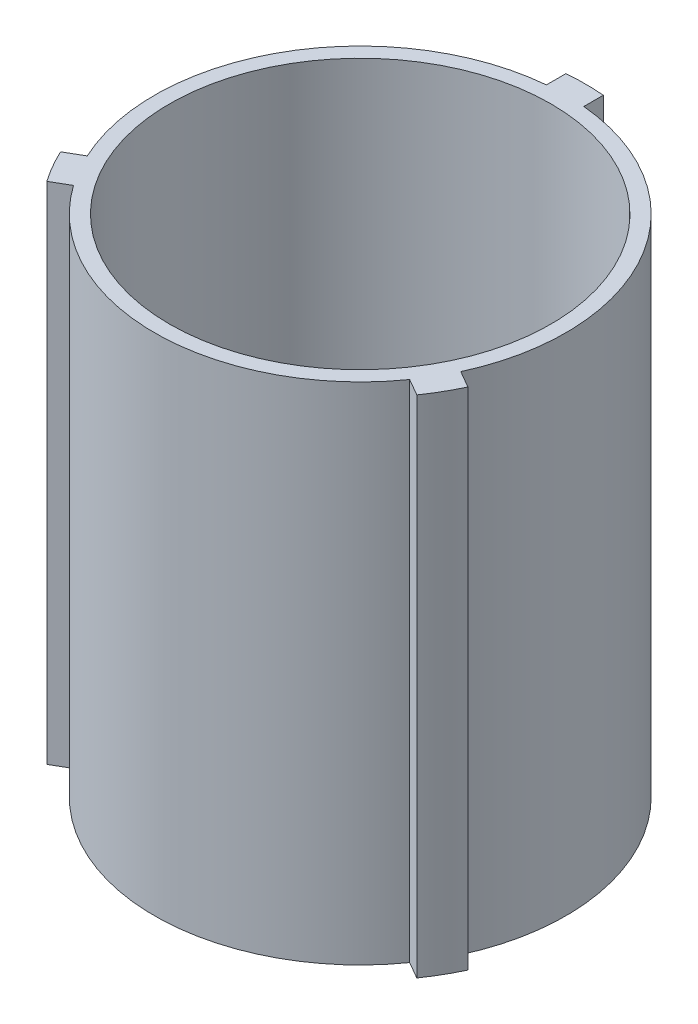
ISO-10303-21;
HEADER;
FILE_DESCRIPTION(('STEP AP214'),'2;1');
FILE_NAME('part.step','',(''),(''),'','','');
FILE_SCHEMA(('AUTOMOTIVE_DESIGN { 1 0 10303 214 1 1 1 1 }'));
ENDSEC;
DATA;
#1=APPLICATION_CONTEXT('core data for automotive mechanical design processes');
#2=APPLICATION_PROTOCOL_DEFINITION('international standard','automotive_design',2000,#1);
#3=PRODUCT_CONTEXT('',#1,'mechanical');
#4=PRODUCT('Part','Part','',(#3));
#5=PRODUCT_RELATED_PRODUCT_CATEGORY('part','',(#4));
#6=PRODUCT_DEFINITION_FORMATION('','',#4);
#7=PRODUCT_DEFINITION_CONTEXT('part definition',#1,'design');
#8=PRODUCT_DEFINITION('design','',#6,#7);
#9=PRODUCT_DEFINITION_SHAPE('','',#8);
#10=(LENGTH_UNIT() NAMED_UNIT(*) SI_UNIT(.MILLI.,.METRE.));
#11=(NAMED_UNIT(*) PLANE_ANGLE_UNIT() SI_UNIT($,.RADIAN.));
#12=(NAMED_UNIT(*) SI_UNIT($,.STERADIAN.) SOLID_ANGLE_UNIT());
#13=UNCERTAINTY_MEASURE_WITH_UNIT(LENGTH_MEASURE(1.E-05),#10,'distance_accuracy_value','');
#14=(GEOMETRIC_REPRESENTATION_CONTEXT(3) GLOBAL_UNCERTAINTY_ASSIGNED_CONTEXT((#13)) GLOBAL_UNIT_ASSIGNED_CONTEXT((#10,
#11,#12)) REPRESENTATION_CONTEXT('',''));
#15=CARTESIAN_POINT('',(0.,0.,0.));
#16=DIRECTION('',(0.,0.,1.));
#17=DIRECTION('',(1.,0.,0.));
#18=AXIS2_PLACEMENT_3D('',#15,#16,#17);
#19=CARTESIAN_POINT('',(0.,85.725,0.));
#20=DIRECTION('',(0.,1.,0.));
#21=DIRECTION('',(0.,0.,1.));
#22=AXIS2_PLACEMENT_3D('',#19,#20,#21);
#23=PLANE('',#22);
#24=CARTESIAN_POINT('',(0.,85.725,0.));
#25=DIRECTION('',(0.,1.,0.));
#26=DIRECTION('',(0.,0.,1.));
#27=AXIS2_PLACEMENT_3D('',#24,#25,#26);
#28=CIRCLE('',#27,38.227);
#29=CARTESIAN_POINT('',(3.175,85.725,-38.0949196612882));
#30=VERTEX_POINT('',#29);
#31=CARTESIAN_POINT('',(-3.175,85.725,-38.0949196612882));
#32=VERTEX_POINT('',#31);
#33=EDGE_CURVE('E179',#30,#32,#28,.T.);
#34=ORIENTED_EDGE('',*,*,#33,.T.);
#35=DIRECTION('',(0.,0.,1.));
#36=VECTOR('',#35,1.);
#37=CARTESIAN_POINT('',(-3.175,85.725,-34.780382401578));
#38=LINE('',#37,#36);
#39=CARTESIAN_POINT('',(-3.17499999999999,85.725,-34.780382401578));
#40=VERTEX_POINT('',#39);
#41=EDGE_CURVE('E107',#32,#40,#38,.T.);
#42=ORIENTED_EDGE('',*,*,#41,.T.);
#43=CARTESIAN_POINT('',(0.,85.725,0.));
#44=DIRECTION('',(0.,1.,0.));
#45=DIRECTION('',(0.,0.,1.));
#46=AXIS2_PLACEMENT_3D('',#43,#44,#45);
#47=CIRCLE('',#46,34.925);
#48=CARTESIAN_POINT('',(-31.7081947131034,85.725,14.6405605437742));
#49=VERTEX_POINT('',#48);
#50=EDGE_CURVE('E206',#40,#49,#47,.T.);
#51=ORIENTED_EDGE('',*,*,#50,.T.);
#52=DIRECTION('',(-0.866025403784438,0.,0.500000000000001));
#53=VECTOR('',#52,1.);
#54=CARTESIAN_POINT('',(-34.5786681818024,85.725,16.2978291736293));
#55=LINE('',#54,#53);
#56=CARTESIAN_POINT('',(-34.5786681818025,85.725,16.2978291736293));
#57=VERTEX_POINT('',#56);
#58=EDGE_CURVE('E225',#49,#57,#55,.T.);
#59=ORIENTED_EDGE('',*,*,#58,.T.);
#60=CARTESIAN_POINT('',(0.,85.725,0.));
#61=DIRECTION('',(0.,1.,0.));
#62=DIRECTION('',(0.,0.,1.));
#63=AXIS2_PLACEMENT_3D('',#60,#61,#62);
#64=CIRCLE('',#63,38.227);
#65=CARTESIAN_POINT('',(-31.4036681818023,85.725,21.7970904876604));
#66=VERTEX_POINT('',#65);
#67=EDGE_CURVE('E222',#57,#66,#64,.T.);
#68=ORIENTED_EDGE('',*,*,#67,.T.);
#69=DIRECTION('',(0.866025403784439,0.,-0.5));
#70=VECTOR('',#69,1.);
#71=CARTESIAN_POINT('',(-28.5331947131033,85.725,20.1398218578053));
#72=LINE('',#71,#70);
#73=CARTESIAN_POINT('',(-28.5331947131033,85.725,20.1398218578053));
#74=VERTEX_POINT('',#73);
#75=EDGE_CURVE('E224',#66,#74,#72,.T.);
#76=ORIENTED_EDGE('',*,*,#75,.T.);
#77=CARTESIAN_POINT('',(0.,85.725,0.));
#78=DIRECTION('',(0.,1.,0.));
#79=DIRECTION('',(0.,0.,1.));
#80=AXIS2_PLACEMENT_3D('',#77,#78,#79);
#81=CIRCLE('',#80,34.925);
#82=CARTESIAN_POINT('',(28.5331947131048,85.725,20.1398218578032));
#83=VERTEX_POINT('',#82);
#84=EDGE_CURVE('E227',#74,#83,#81,.T.);
#85=ORIENTED_EDGE('',*,*,#84,.T.);
#86=DIRECTION('',(0.866025403784439,0.,0.499999999999998));
#87=VECTOR('',#86,1.);
#88=CARTESIAN_POINT('',(31.4036681818038,85.725,21.7970904876583));
#89=LINE('',#88,#87);
#90=CARTESIAN_POINT('',(31.4036681818038,85.725,21.7970904876583));
#91=VERTEX_POINT('',#90);
#92=EDGE_CURVE('E233',#83,#91,#89,.T.);
#93=ORIENTED_EDGE('',*,*,#92,.T.);
#94=CARTESIAN_POINT('',(0.,85.725,0.));
#95=DIRECTION('',(0.,1.,0.));
#96=DIRECTION('',(0.,0.,1.));
#97=AXIS2_PLACEMENT_3D('',#94,#95,#96);
#98=CIRCLE('',#97,38.227);
#99=CARTESIAN_POINT('',(34.5786681818036,85.725,16.2978291736269));
#100=VERTEX_POINT('',#99);
#101=EDGE_CURVE('E138',#91,#100,#98,.T.);
#102=ORIENTED_EDGE('',*,*,#101,.T.);
#103=DIRECTION('',(-0.866025403784438,0.,-0.500000000000001));
#104=VECTOR('',#103,1.);
#105=CARTESIAN_POINT('',(31.7081947131045,85.725,14.6405605437719));
#106=LINE('',#105,#104);
#107=CARTESIAN_POINT('',(31.7081947131045,85.725,14.6405605437719));
#108=VERTEX_POINT('',#107);
#109=EDGE_CURVE('E132',#100,#108,#106,.T.);
#110=ORIENTED_EDGE('',*,*,#109,.T.);
#111=CARTESIAN_POINT('',(0.,85.725,0.));
#112=DIRECTION('',(0.,1.,0.));
#113=DIRECTION('',(0.,0.,1.));
#114=AXIS2_PLACEMENT_3D('',#111,#112,#113);
#115=CIRCLE('',#114,34.925);
#116=CARTESIAN_POINT('',(3.175,85.725,-34.780382401578));
#117=VERTEX_POINT('',#116);
#118=EDGE_CURVE('E136',#108,#117,#115,.T.);
#119=ORIENTED_EDGE('',*,*,#118,.T.);
#120=DIRECTION('',(0.,0.,-1.));
#121=VECTOR('',#120,1.);
#122=CARTESIAN_POINT('',(3.175,85.725,-38.0949196612882));
#123=LINE('',#122,#121);
#124=EDGE_CURVE('E52',#117,#30,#123,.T.);
#125=ORIENTED_EDGE('',*,*,#124,.T.);
#126=EDGE_LOOP('',(#34,#42,#51,#59,#68,#76,#85,#93,#102,#110,#119,#125));
#127=FACE_BOUND('',#126,.T.);
#128=CARTESIAN_POINT('',(0.,85.725,0.));
#129=DIRECTION('',(0.,1.,0.));
#130=DIRECTION('',(0.,0.,1.));
#131=AXIS2_PLACEMENT_3D('',#128,#129,#130);
#132=CIRCLE('',#131,32.385);
#133=CARTESIAN_POINT('',(0.,85.725,32.385));
#134=VERTEX_POINT('',#133);
#135=EDGE_CURVE('E160',#134,#134,#132,.T.);
#136=ORIENTED_EDGE('',*,*,#135,.F.);
#137=EDGE_LOOP('',(#136));
#138=FACE_BOUND('',#137,.T.);
#139=ADVANCED_FACE('F35',(#127,#138),#23,.T.);
#140=CARTESIAN_POINT('',(0.,0.,0.));
#141=DIRECTION('',(0.,1.,0.));
#142=DIRECTION('',(0.,0.,1.));
#143=AXIS2_PLACEMENT_3D('',#140,#141,#142);
#144=PLANE('',#143);
#145=CARTESIAN_POINT('',(0.,0.,0.));
#146=DIRECTION('',(0.,1.,0.));
#147=DIRECTION('',(0.,0.,1.));
#148=AXIS2_PLACEMENT_3D('',#145,#146,#147);
#149=CIRCLE('',#148,38.227);
#150=CARTESIAN_POINT('',(3.175,0.,-38.0949196612882));
#151=VERTEX_POINT('',#150);
#152=CARTESIAN_POINT('',(-3.175,0.,-38.0949196612882));
#153=VERTEX_POINT('',#152);
#154=EDGE_CURVE('E156',#151,#153,#149,.T.);
#155=ORIENTED_EDGE('',*,*,#154,.F.);
#156=DIRECTION('',(0.,0.,-1.));
#157=VECTOR('',#156,1.);
#158=CARTESIAN_POINT('',(3.175,0.,-38.0949196612882));
#159=LINE('',#158,#157);
#160=CARTESIAN_POINT('',(3.175,0.,-34.780382401578));
#161=VERTEX_POINT('',#160);
#162=EDGE_CURVE('E99',#161,#151,#159,.T.);
#163=ORIENTED_EDGE('',*,*,#162,.F.);
#164=CARTESIAN_POINT('',(0.,0.,0.));
#165=DIRECTION('',(0.,1.,0.));
#166=DIRECTION('',(0.,0.,1.));
#167=AXIS2_PLACEMENT_3D('',#164,#165,#166);
#168=CIRCLE('',#167,34.925);
#169=CARTESIAN_POINT('',(31.7081947131045,0.,14.6405605437719));
#170=VERTEX_POINT('',#169);
#171=EDGE_CURVE('E93',#170,#161,#168,.T.);
#172=ORIENTED_EDGE('',*,*,#171,.F.);
#173=DIRECTION('',(-0.866025403784438,0.,-0.500000000000001));
#174=VECTOR('',#173,1.);
#175=CARTESIAN_POINT('',(31.7081947131045,0.,14.6405605437719));
#176=LINE('',#175,#174);
#177=CARTESIAN_POINT('',(34.5786681818036,0.,16.2978291736269));
#178=VERTEX_POINT('',#177);
#179=EDGE_CURVE('E146',#178,#170,#176,.T.);
#180=ORIENTED_EDGE('',*,*,#179,.F.);
#181=CARTESIAN_POINT('',(0.,0.,0.));
#182=DIRECTION('',(0.,1.,0.));
#183=DIRECTION('',(0.,0.,1.));
#184=AXIS2_PLACEMENT_3D('',#181,#182,#183);
#185=CIRCLE('',#184,38.227);
#186=CARTESIAN_POINT('',(31.4036681818038,0.,21.7970904876583));
#187=VERTEX_POINT('',#186);
#188=EDGE_CURVE('E174',#187,#178,#185,.T.);
#189=ORIENTED_EDGE('',*,*,#188,.F.);
#190=DIRECTION('',(0.866025403784439,0.,0.499999999999998));
#191=VECTOR('',#190,1.);
#192=CARTESIAN_POINT('',(31.4036681818038,0.,21.7970904876583));
#193=LINE('',#192,#191);
#194=CARTESIAN_POINT('',(28.5331947131048,0.,20.1398218578032));
#195=VERTEX_POINT('',#194);
#196=EDGE_CURVE('E172',#195,#187,#193,.T.);
#197=ORIENTED_EDGE('',*,*,#196,.F.);
#198=CARTESIAN_POINT('',(0.,0.,0.));
#199=DIRECTION('',(0.,1.,0.));
#200=DIRECTION('',(0.,0.,1.));
#201=AXIS2_PLACEMENT_3D('',#198,#199,#200);
#202=CIRCLE('',#201,34.925);
#203=CARTESIAN_POINT('',(-28.5331947131033,0.,20.1398218578053));
#204=VERTEX_POINT('',#203);
#205=EDGE_CURVE('E170',#204,#195,#202,.T.);
#206=ORIENTED_EDGE('',*,*,#205,.F.);
#207=DIRECTION('',(0.866025403784439,0.,-0.5));
#208=VECTOR('',#207,1.);
#209=CARTESIAN_POINT('',(-28.5331947131033,0.,20.1398218578053));
#210=LINE('',#209,#208);
#211=CARTESIAN_POINT('',(-31.4036681818023,0.,21.7970904876604));
#212=VERTEX_POINT('',#211);
#213=EDGE_CURVE('E168',#212,#204,#210,.T.);
#214=ORIENTED_EDGE('',*,*,#213,.F.);
#215=CARTESIAN_POINT('',(0.,0.,0.));
#216=DIRECTION('',(0.,1.,0.));
#217=DIRECTION('',(0.,0.,1.));
#218=AXIS2_PLACEMENT_3D('',#215,#216,#217);
#219=CIRCLE('',#218,38.227);
#220=CARTESIAN_POINT('',(-34.5786681818025,0.,16.2978291736293));
#221=VERTEX_POINT('',#220);
#222=EDGE_CURVE('E166',#221,#212,#219,.T.);
#223=ORIENTED_EDGE('',*,*,#222,.F.);
#224=DIRECTION('',(-0.866025403784438,0.,0.500000000000001));
#225=VECTOR('',#224,1.);
#226=CARTESIAN_POINT('',(-34.5786681818024,0.,16.2978291736293));
#227=LINE('',#226,#225);
#228=CARTESIAN_POINT('',(-31.7081947131034,0.,14.6405605437742));
#229=VERTEX_POINT('',#228);
#230=EDGE_CURVE('E164',#229,#221,#227,.T.);
#231=ORIENTED_EDGE('',*,*,#230,.F.);
#232=CARTESIAN_POINT('',(0.,0.,0.));
#233=DIRECTION('',(0.,1.,0.));
#234=DIRECTION('',(0.,0.,1.));
#235=AXIS2_PLACEMENT_3D('',#232,#233,#234);
#236=CIRCLE('',#235,34.925);
#237=CARTESIAN_POINT('',(-3.17499999999999,0.,-34.780382401578));
#238=VERTEX_POINT('',#237);
#239=EDGE_CURVE('E162',#238,#229,#236,.T.);
#240=ORIENTED_EDGE('',*,*,#239,.F.);
#241=DIRECTION('',(0.,0.,1.));
#242=VECTOR('',#241,1.);
#243=CARTESIAN_POINT('',(-3.175,0.,-34.780382401578));
#244=LINE('',#243,#242);
#245=EDGE_CURVE('E159',#153,#238,#244,.T.);
#246=ORIENTED_EDGE('',*,*,#245,.F.);
#247=EDGE_LOOP('',(#155,#163,#172,#180,#189,#197,#206,#214,#223,#231,#240,#246));
#248=FACE_BOUND('',#247,.T.);
#249=CARTESIAN_POINT('',(0.,0.,0.));
#250=DIRECTION('',(0.,1.,0.));
#251=DIRECTION('',(0.,0.,1.));
#252=AXIS2_PLACEMENT_3D('',#249,#250,#251);
#253=CIRCLE('',#252,32.385);
#254=CARTESIAN_POINT('',(0.,0.,32.385));
#255=VERTEX_POINT('',#254);
#256=EDGE_CURVE('E380',#255,#255,#253,.T.);
#257=ORIENTED_EDGE('',*,*,#256,.T.);
#258=EDGE_LOOP('',(#257));
#259=FACE_BOUND('',#258,.T.);
#260=ADVANCED_FACE('F210',(#248,#259),#144,.F.);
#261=CARTESIAN_POINT('',(0.,85.725,0.));
#262=DIRECTION('',(0.,-1.,0.));
#263=DIRECTION('',(0.,0.,-1.));
#264=AXIS2_PLACEMENT_3D('',#261,#262,#263);
#265=CYLINDRICAL_SURFACE('',#264,38.227);
#266=ORIENTED_EDGE('',*,*,#154,.T.);
#267=DIRECTION('',(0.,-1.,0.));
#268=VECTOR('',#267,1.);
#269=CARTESIAN_POINT('',(-3.175,85.725,-38.0949196612882));
#270=LINE('',#269,#268);
#271=EDGE_CURVE('E11',#32,#153,#270,.T.);
#272=ORIENTED_EDGE('',*,*,#271,.F.);
#273=ORIENTED_EDGE('',*,*,#33,.F.);
#274=DIRECTION('',(0.,-1.,0.));
#275=VECTOR('',#274,1.);
#276=CARTESIAN_POINT('',(3.175,85.725,-38.0949196612882));
#277=LINE('',#276,#275);
#278=EDGE_CURVE('E152',#30,#151,#277,.T.);
#279=ORIENTED_EDGE('',*,*,#278,.T.);
#280=EDGE_LOOP('',(#266,#272,#273,#279));
#281=FACE_BOUND('',#280,.T.);
#282=ADVANCED_FACE('F37',(#281),#265,.T.);
#283=CARTESIAN_POINT('',(-3.175,85.725,-34.780382401578));
#284=DIRECTION('',(1.,0.,0.));
#285=DIRECTION('',(0.,0.,-1.));
#286=AXIS2_PLACEMENT_3D('',#283,#284,#285);
#287=PLANE('',#286);
#288=ORIENTED_EDGE('',*,*,#245,.T.);
#289=DIRECTION('',(0.,-1.,0.));
#290=VECTOR('',#289,1.);
#291=CARTESIAN_POINT('',(-3.17499999999999,85.725,-34.780382401578));
#292=LINE('',#291,#290);
#293=EDGE_CURVE('E44',#40,#238,#292,.T.);
#294=ORIENTED_EDGE('',*,*,#293,.F.);
#295=ORIENTED_EDGE('',*,*,#41,.F.);
#296=ORIENTED_EDGE('',*,*,#271,.T.);
#297=EDGE_LOOP('',(#288,#294,#295,#296));
#298=FACE_BOUND('',#297,.T.);
#299=ADVANCED_FACE('F267',(#298),#287,.F.);
#300=CARTESIAN_POINT('',(0.,85.725,0.));
#301=DIRECTION('',(0.,-1.,0.));
#302=DIRECTION('',(0.,0.,-1.));
#303=AXIS2_PLACEMENT_3D('',#300,#301,#302);
#304=CYLINDRICAL_SURFACE('',#303,34.925);
#305=ORIENTED_EDGE('',*,*,#239,.T.);
#306=DIRECTION('',(0.,-1.,0.));
#307=VECTOR('',#306,1.);
#308=CARTESIAN_POINT('',(-31.7081947131034,85.725,14.6405605437742));
#309=LINE('',#308,#307);
#310=EDGE_CURVE('E198',#49,#229,#309,.T.);
#311=ORIENTED_EDGE('',*,*,#310,.F.);
#312=ORIENTED_EDGE('',*,*,#50,.F.);
#313=ORIENTED_EDGE('',*,*,#293,.T.);
#314=EDGE_LOOP('',(#305,#311,#312,#313));
#315=FACE_BOUND('',#314,.T.);
#316=ADVANCED_FACE('F204',(#315),#304,.T.);
#317=CARTESIAN_POINT('',(-34.5786681818024,85.725,16.2978291736293));
#318=DIRECTION('',(0.500000000000001,0.,0.866025403784438));
#319=DIRECTION('',(0.866025403784438,0.,-0.500000000000001));
#320=AXIS2_PLACEMENT_3D('',#317,#318,#319);
#321=PLANE('',#320);
#322=ORIENTED_EDGE('',*,*,#230,.T.);
#323=DIRECTION('',(0.,-1.,0.));
#324=VECTOR('',#323,1.);
#325=CARTESIAN_POINT('',(-34.5786681818025,85.725,16.2978291736293));
#326=LINE('',#325,#324);
#327=EDGE_CURVE('E195',#57,#221,#326,.T.);
#328=ORIENTED_EDGE('',*,*,#327,.F.);
#329=ORIENTED_EDGE('',*,*,#58,.F.);
#330=ORIENTED_EDGE('',*,*,#310,.T.);
#331=EDGE_LOOP('',(#322,#328,#329,#330));
#332=FACE_BOUND('',#331,.T.);
#333=ADVANCED_FACE('F216',(#332),#321,.F.);
#334=CARTESIAN_POINT('',(0.,85.725,0.));
#335=DIRECTION('',(0.,-1.,0.));
#336=DIRECTION('',(0.,0.,-1.));
#337=AXIS2_PLACEMENT_3D('',#334,#335,#336);
#338=CYLINDRICAL_SURFACE('',#337,38.227);
#339=ORIENTED_EDGE('',*,*,#222,.T.);
#340=DIRECTION('',(0.,-1.,0.));
#341=VECTOR('',#340,1.);
#342=CARTESIAN_POINT('',(-31.4036681818023,85.725,21.7970904876604));
#343=LINE('',#342,#341);
#344=EDGE_CURVE('E192',#66,#212,#343,.T.);
#345=ORIENTED_EDGE('',*,*,#344,.F.);
#346=ORIENTED_EDGE('',*,*,#67,.F.);
#347=ORIENTED_EDGE('',*,*,#327,.T.);
#348=EDGE_LOOP('',(#339,#345,#346,#347));
#349=FACE_BOUND('',#348,.T.);
#350=ADVANCED_FACE('F220',(#349),#338,.T.);
#351=CARTESIAN_POINT('',(-28.5331947131033,85.725,20.1398218578053));
#352=DIRECTION('',(-0.5,0.,-0.866025403784439));
#353=DIRECTION('',(-0.866025403784439,0.,0.5));
#354=AXIS2_PLACEMENT_3D('',#351,#352,#353);
#355=PLANE('',#354);
#356=ORIENTED_EDGE('',*,*,#213,.T.);
#357=DIRECTION('',(0.,-1.,0.));
#358=VECTOR('',#357,1.);
#359=CARTESIAN_POINT('',(-28.5331947131033,85.725,20.1398218578053));
#360=LINE('',#359,#358);
#361=EDGE_CURVE('E189',#74,#204,#360,.T.);
#362=ORIENTED_EDGE('',*,*,#361,.F.);
#363=ORIENTED_EDGE('',*,*,#75,.F.);
#364=ORIENTED_EDGE('',*,*,#344,.T.);
#365=EDGE_LOOP('',(#356,#362,#363,#364));
#366=FACE_BOUND('',#365,.T.);
#367=ADVANCED_FACE('F280',(#366),#355,.F.);
#368=CARTESIAN_POINT('',(0.,85.725,0.));
#369=DIRECTION('',(0.,-1.,0.));
#370=DIRECTION('',(0.,0.,-1.));
#371=AXIS2_PLACEMENT_3D('',#368,#369,#370);
#372=CYLINDRICAL_SURFACE('',#371,34.925);
#373=ORIENTED_EDGE('',*,*,#205,.T.);
#374=DIRECTION('',(0.,-1.,0.));
#375=VECTOR('',#374,1.);
#376=CARTESIAN_POINT('',(28.5331947131048,85.725,20.1398218578032));
#377=LINE('',#376,#375);
#378=EDGE_CURVE('E186',#83,#195,#377,.T.);
#379=ORIENTED_EDGE('',*,*,#378,.F.);
#380=ORIENTED_EDGE('',*,*,#84,.F.);
#381=ORIENTED_EDGE('',*,*,#361,.T.);
#382=EDGE_LOOP('',(#373,#379,#380,#381));
#383=FACE_BOUND('',#382,.T.);
#384=ADVANCED_FACE('F283',(#383),#372,.T.);
#385=CARTESIAN_POINT('',(31.4036681818038,85.725,21.7970904876583));
#386=DIRECTION('',(0.499999999999998,0.,-0.866025403784439));
#387=DIRECTION('',(-0.86602540378444,0.,-0.499999999999999));
#388=AXIS2_PLACEMENT_3D('',#385,#386,#387);
#389=PLANE('',#388);
#390=ORIENTED_EDGE('',*,*,#196,.T.);
#391=DIRECTION('',(0.,-1.,0.));
#392=VECTOR('',#391,1.);
#393=CARTESIAN_POINT('',(31.4036681818038,85.725,21.7970904876583));
#394=LINE('',#393,#392);
#395=EDGE_CURVE('E183',#91,#187,#394,.T.);
#396=ORIENTED_EDGE('',*,*,#395,.F.);
#397=ORIENTED_EDGE('',*,*,#92,.F.);
#398=ORIENTED_EDGE('',*,*,#378,.T.);
#399=EDGE_LOOP('',(#390,#396,#397,#398));
#400=FACE_BOUND('',#399,.T.);
#401=ADVANCED_FACE('F239',(#400),#389,.F.);
#402=CARTESIAN_POINT('',(0.,85.725,0.));
#403=DIRECTION('',(0.,-1.,0.));
#404=DIRECTION('',(0.,0.,-1.));
#405=AXIS2_PLACEMENT_3D('',#402,#403,#404);
#406=CYLINDRICAL_SURFACE('',#405,38.227);
#407=ORIENTED_EDGE('',*,*,#188,.T.);
#408=DIRECTION('',(0.,-1.,0.));
#409=VECTOR('',#408,1.);
#410=CARTESIAN_POINT('',(34.5786681818036,85.725,16.2978291736269));
#411=LINE('',#410,#409);
#412=EDGE_CURVE('E147',#100,#178,#411,.T.);
#413=ORIENTED_EDGE('',*,*,#412,.F.);
#414=ORIENTED_EDGE('',*,*,#101,.F.);
#415=ORIENTED_EDGE('',*,*,#395,.T.);
#416=EDGE_LOOP('',(#407,#413,#414,#415));
#417=FACE_BOUND('',#416,.T.);
#418=ADVANCED_FACE('F243',(#417),#406,.T.);
#419=CARTESIAN_POINT('',(31.7081947131045,85.725,14.6405605437719));
#420=DIRECTION('',(-0.500000000000002,0.,0.866025403784438));
#421=DIRECTION('',(0.866025403784438,0.,0.500000000000002));
#422=AXIS2_PLACEMENT_3D('',#419,#420,#421);
#423=PLANE('',#422);
#424=ORIENTED_EDGE('',*,*,#179,.T.);
#425=DIRECTION('',(0.,-1.,0.));
#426=VECTOR('',#425,1.);
#427=CARTESIAN_POINT('',(31.7081947131045,85.725,14.6405605437719));
#428=LINE('',#427,#426);
#429=EDGE_CURVE('E143',#108,#170,#428,.T.);
#430=ORIENTED_EDGE('',*,*,#429,.F.);
#431=ORIENTED_EDGE('',*,*,#109,.F.);
#432=ORIENTED_EDGE('',*,*,#412,.T.);
#433=EDGE_LOOP('',(#424,#430,#431,#432));
#434=FACE_BOUND('',#433,.T.);
#435=ADVANCED_FACE('F144',(#434),#423,.F.);
#436=CARTESIAN_POINT('',(0.,85.725,0.));
#437=DIRECTION('',(0.,-1.,0.));
#438=DIRECTION('',(0.,0.,-1.));
#439=AXIS2_PLACEMENT_3D('',#436,#437,#438);
#440=CYLINDRICAL_SURFACE('',#439,34.925);
#441=ORIENTED_EDGE('',*,*,#171,.T.);
#442=DIRECTION('',(0.,-1.,0.));
#443=VECTOR('',#442,1.);
#444=CARTESIAN_POINT('',(3.175,85.725,-34.780382401578));
#445=LINE('',#444,#443);
#446=EDGE_CURVE('E148',#117,#161,#445,.T.);
#447=ORIENTED_EDGE('',*,*,#446,.F.);
#448=ORIENTED_EDGE('',*,*,#118,.F.);
#449=ORIENTED_EDGE('',*,*,#429,.T.);
#450=EDGE_LOOP('',(#441,#447,#448,#449));
#451=FACE_BOUND('',#450,.T.);
#452=ADVANCED_FACE('F150',(#451),#440,.T.);
#453=CARTESIAN_POINT('',(3.175,85.725,-38.0949196612882));
#454=DIRECTION('',(-1.,0.,0.));
#455=DIRECTION('',(0.,0.,1.));
#456=AXIS2_PLACEMENT_3D('',#453,#454,#455);
#457=PLANE('',#456);
#458=ORIENTED_EDGE('',*,*,#162,.T.);
#459=ORIENTED_EDGE('',*,*,#278,.F.);
#460=ORIENTED_EDGE('',*,*,#124,.F.);
#461=ORIENTED_EDGE('',*,*,#446,.T.);
#462=EDGE_LOOP('',(#458,#459,#460,#461));
#463=FACE_BOUND('',#462,.T.);
#464=ADVANCED_FACE('F247',(#463),#457,.F.);
#465=CARTESIAN_POINT('',(0.,85.725,0.));
#466=DIRECTION('',(0.,-1.,0.));
#467=DIRECTION('',(0.,0.,-1.));
#468=AXIS2_PLACEMENT_3D('',#465,#466,#467);
#469=CYLINDRICAL_SURFACE('',#468,32.385);
#470=ORIENTED_EDGE('',*,*,#135,.T.);
#471=EDGE_LOOP('',(#470));
#472=FACE_BOUND('',#471,.T.);
#473=ORIENTED_EDGE('',*,*,#256,.F.);
#474=EDGE_LOOP('',(#473));
#475=FACE_BOUND('',#474,.T.);
#476=ADVANCED_FACE('F249',(#472,#475),#469,.F.);
#477=CLOSED_SHELL('',(#139,#260,#282,#299,#316,#333,#350,#367,#384,#401,#418,#435,#452,#464,#476));
#478=MANIFOLD_SOLID_BREP('B2',#477);
#479=ADVANCED_BREP_SHAPE_REPRESENTATION('',(#18,#478),#14);
#480=SHAPE_DEFINITION_REPRESENTATION(#9,#479);
ENDSEC;
END-ISO-10303-21;
